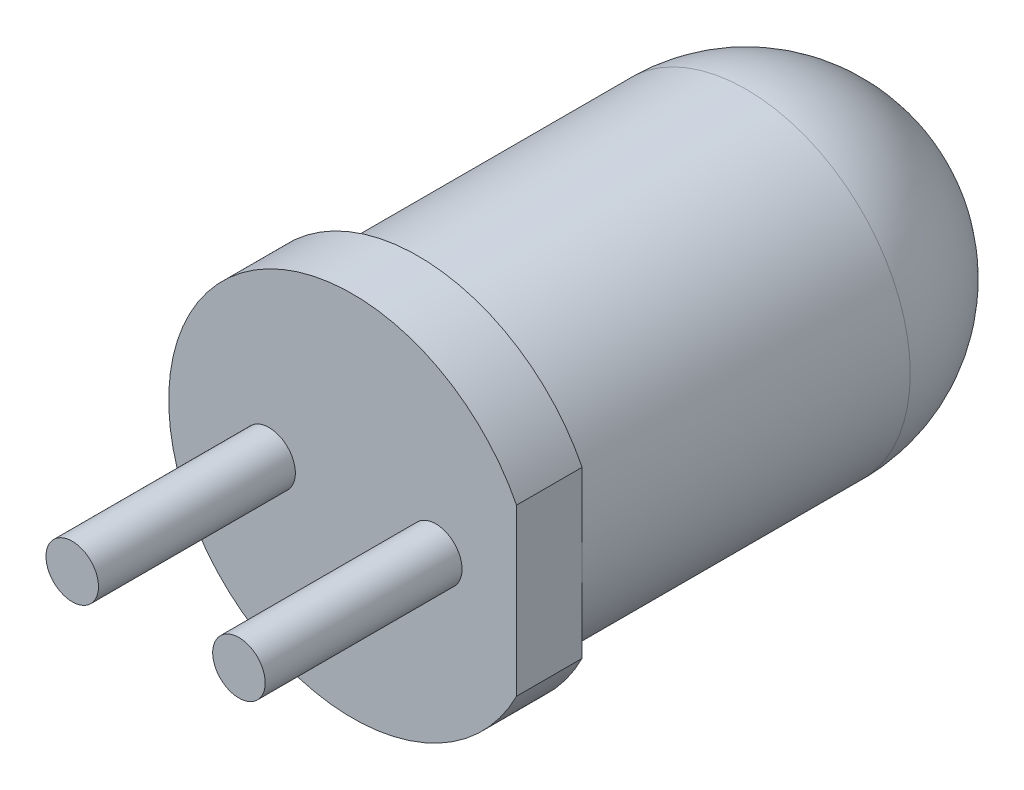
ISO-10303-21;
HEADER;
FILE_DESCRIPTION(('STEP AP214'),'2;1');
FILE_NAME('part.step','',(''),(''),'','','');
FILE_SCHEMA(('AUTOMOTIVE_DESIGN { 1 0 10303 214 1 1 1 1 }'));
ENDSEC;
DATA;
#1=APPLICATION_CONTEXT('core data for automotive mechanical design processes');
#2=APPLICATION_PROTOCOL_DEFINITION('international standard','automotive_design',2000,#1);
#3=PRODUCT_CONTEXT('',#1,'mechanical');
#4=PRODUCT('Part','Part','',(#3));
#5=PRODUCT_RELATED_PRODUCT_CATEGORY('part','',(#4));
#6=PRODUCT_DEFINITION_FORMATION('','',#4);
#7=PRODUCT_DEFINITION_CONTEXT('part definition',#1,'design');
#8=PRODUCT_DEFINITION('design','',#6,#7);
#9=PRODUCT_DEFINITION_SHAPE('','',#8);
#10=(LENGTH_UNIT() NAMED_UNIT(*) SI_UNIT(.MILLI.,.METRE.));
#11=(NAMED_UNIT(*) PLANE_ANGLE_UNIT() SI_UNIT($,.RADIAN.));
#12=(NAMED_UNIT(*) SI_UNIT($,.STERADIAN.) SOLID_ANGLE_UNIT());
#13=UNCERTAINTY_MEASURE_WITH_UNIT(LENGTH_MEASURE(1.E-05),#10,'distance_accuracy_value','');
#14=(GEOMETRIC_REPRESENTATION_CONTEXT(3) GLOBAL_UNCERTAINTY_ASSIGNED_CONTEXT((#13)) GLOBAL_UNIT_ASSIGNED_CONTEXT((#10,
#11,#12)) REPRESENTATION_CONTEXT('',''));
#15=CARTESIAN_POINT('',(0.,0.,0.));
#16=DIRECTION('',(0.,0.,1.));
#17=DIRECTION('',(1.,0.,0.));
#18=AXIS2_PLACEMENT_3D('',#15,#16,#17);
#19=CARTESIAN_POINT('',(0.,0.,8.5));
#20=DIRECTION('',(0.,0.,1.));
#21=DIRECTION('',(1.,0.,0.));
#22=AXIS2_PLACEMENT_3D('',#19,#20,#21);
#23=PLANE('',#22);
#24=CARTESIAN_POINT('',(1.27,0.,8.5));
#25=DIRECTION('',(0.,0.,1.));
#26=DIRECTION('',(1.,0.,0.));
#27=AXIS2_PLACEMENT_3D('',#24,#25,#26);
#28=CIRCLE('',#27,0.4);
#29=CARTESIAN_POINT('',(1.67,0.,8.5));
#30=VERTEX_POINT('',#29);
#31=EDGE_CURVE('E135',#30,#30,#28,.T.);
#32=ORIENTED_EDGE('',*,*,#31,.F.);
#33=EDGE_LOOP('',(#32));
#34=FACE_BOUND('',#33,.T.);
#35=DIRECTION('',(0.,1.,0.));
#36=VECTOR('',#35,1.);
#37=CARTESIAN_POINT('',(2.5,1.26095202129185,8.5));
#38=LINE('',#37,#36);
#39=CARTESIAN_POINT('',(2.5,-1.26095202129185,8.5));
#40=VERTEX_POINT('',#39);
#41=CARTESIAN_POINT('',(2.5,1.26095202129185,8.5));
#42=VERTEX_POINT('',#41);
#43=EDGE_CURVE('E79',#40,#42,#38,.T.);
#44=ORIENTED_EDGE('',*,*,#43,.T.);
#45=CARTESIAN_POINT('',(0.,0.,8.5));
#46=DIRECTION('',(0.,0.,1.));
#47=DIRECTION('',(1.,0.,0.));
#48=AXIS2_PLACEMENT_3D('',#45,#46,#47);
#49=CIRCLE('',#48,2.8);
#50=EDGE_CURVE('E69',#42,#40,#49,.T.);
#51=ORIENTED_EDGE('',*,*,#50,.T.);
#52=EDGE_LOOP('',(#44,#51));
#53=FACE_BOUND('',#52,.T.);
#54=CARTESIAN_POINT('',(-1.27,0.,8.5));
#55=DIRECTION('',(0.,0.,1.));
#56=DIRECTION('',(-1.,0.,0.));
#57=AXIS2_PLACEMENT_3D('',#54,#55,#56);
#58=CIRCLE('',#57,0.4);
#59=CARTESIAN_POINT('',(-1.67,0.,8.5));
#60=VERTEX_POINT('',#59);
#61=EDGE_CURVE('E136',#60,#60,#58,.T.);
#62=ORIENTED_EDGE('',*,*,#61,.F.);
#63=EDGE_LOOP('',(#62));
#64=FACE_BOUND('',#63,.T.);
#65=ADVANCED_FACE('F34',(#34,#53,#64),#23,.T.);
#66=CARTESIAN_POINT('',(0.,0.,8.5));
#67=DIRECTION('',(0.,0.,-1.));
#68=DIRECTION('',(-1.,0.,0.));
#69=AXIS2_PLACEMENT_3D('',#66,#67,#68);
#70=CYLINDRICAL_SURFACE('',#69,2.5);
#71=CARTESIAN_POINT('',(0.,0.,2.5));
#72=DIRECTION('',(0.,0.,-1.));
#73=DIRECTION('',(-1.,0.,0.));
#74=AXIS2_PLACEMENT_3D('',#71,#72,#73);
#75=CIRCLE('',#74,2.5);
#76=CARTESIAN_POINT('',(-2.5,0.,2.5));
#77=VERTEX_POINT('',#76);
#78=EDGE_CURVE('E11',#77,#77,#75,.F.);
#79=ORIENTED_EDGE('',*,*,#78,.T.);
#80=EDGE_LOOP('',(#79));
#81=FACE_BOUND('',#80,.T.);
#82=CARTESIAN_POINT('',(0.,0.,7.5));
#83=DIRECTION('',(0.,0.,1.));
#84=DIRECTION('',(1.,0.,0.));
#85=AXIS2_PLACEMENT_3D('',#82,#83,#84);
#86=CIRCLE('',#85,2.5);
#87=CARTESIAN_POINT('',(2.5,0.,7.5));
#88=VERTEX_POINT('',#87);
#89=EDGE_CURVE('E42',#88,#88,#86,.T.);
#90=ORIENTED_EDGE('',*,*,#89,.F.);
#91=EDGE_LOOP('',(#90));
#92=FACE_BOUND('',#91,.T.);
#93=ADVANCED_FACE('F36',(#81,#92),#70,.T.);
#94=CARTESIAN_POINT('',(0.,0.,7.5));
#95=DIRECTION('',(0.,0.,1.));
#96=DIRECTION('',(1.,0.,0.));
#97=AXIS2_PLACEMENT_3D('',#94,#95,#96);
#98=PLANE('',#97);
#99=DIRECTION('',(0.,1.,0.));
#100=VECTOR('',#99,1.);
#101=CARTESIAN_POINT('',(2.5,1.26095202129185,7.5));
#102=LINE('',#101,#100);
#103=CARTESIAN_POINT('',(2.5,1.26095202129185,7.5));
#104=VERTEX_POINT('',#103);
#105=EDGE_CURVE('E53',#88,#104,#102,.T.);
#106=ORIENTED_EDGE('',*,*,#105,.F.);
#107=ORIENTED_EDGE('',*,*,#89,.T.);
#108=CARTESIAN_POINT('',(2.5,-1.26095202129185,7.5));
#109=VERTEX_POINT('',#108);
#110=EDGE_CURVE('E75',#109,#88,#102,.T.);
#111=ORIENTED_EDGE('',*,*,#110,.F.);
#112=CARTESIAN_POINT('',(0.,0.,7.5));
#113=DIRECTION('',(0.,0.,1.));
#114=DIRECTION('',(1.,0.,0.));
#115=AXIS2_PLACEMENT_3D('',#112,#113,#114);
#116=CIRCLE('',#115,2.8);
#117=EDGE_CURVE('E71',#104,#109,#116,.T.);
#118=ORIENTED_EDGE('',*,*,#117,.F.);
#119=EDGE_LOOP('',(#106,#107,#111,#118));
#120=FACE_BOUND('',#119,.T.);
#121=ADVANCED_FACE('F89',(#120),#98,.F.);
#122=CARTESIAN_POINT('',(2.5,1.26095202129185,7.5));
#123=DIRECTION('',(1.,0.,0.));
#124=DIRECTION('',(0.,0.,-1.));
#125=AXIS2_PLACEMENT_3D('',#122,#123,#124);
#126=PLANE('',#125);
#127=ORIENTED_EDGE('',*,*,#110,.T.);
#128=ORIENTED_EDGE('',*,*,#105,.T.);
#129=DIRECTION('',(0.,0.,1.));
#130=VECTOR('',#129,1.);
#131=CARTESIAN_POINT('',(2.5,1.26095202129185,7.5));
#132=LINE('',#131,#130);
#133=EDGE_CURVE('E74',#104,#42,#132,.T.);
#134=ORIENTED_EDGE('',*,*,#133,.T.);
#135=ORIENTED_EDGE('',*,*,#43,.F.);
#136=DIRECTION('',(0.,0.,1.));
#137=VECTOR('',#136,1.);
#138=CARTESIAN_POINT('',(2.5,-1.26095202129185,7.5));
#139=LINE('',#138,#137);
#140=EDGE_CURVE('E66',#109,#40,#139,.T.);
#141=ORIENTED_EDGE('',*,*,#140,.F.);
#142=EDGE_LOOP('',(#127,#128,#134,#135,#141));
#143=FACE_BOUND('',#142,.T.);
#144=ADVANCED_FACE('F82',(#143),#126,.T.);
#145=CARTESIAN_POINT('',(0.,0.,7.5));
#146=DIRECTION('',(0.,0.,1.));
#147=DIRECTION('',(1.,0.,0.));
#148=AXIS2_PLACEMENT_3D('',#145,#146,#147);
#149=CYLINDRICAL_SURFACE('',#148,2.8);
#150=ORIENTED_EDGE('',*,*,#50,.F.);
#151=ORIENTED_EDGE('',*,*,#133,.F.);
#152=ORIENTED_EDGE('',*,*,#117,.T.);
#153=ORIENTED_EDGE('',*,*,#140,.T.);
#154=EDGE_LOOP('',(#150,#151,#152,#153));
#155=FACE_BOUND('',#154,.T.);
#156=ADVANCED_FACE('F68',(#155),#149,.T.);
#157=CARTESIAN_POINT('',(0.,0.,2.5));
#158=DIRECTION('',(0.,0.,1.));
#159=DIRECTION('',(1.,0.,0.));
#160=AXIS2_PLACEMENT_3D('',#157,#158,#159);
#161=SPHERICAL_SURFACE('',#160,2.5);
#162=ORIENTED_EDGE('',*,*,#78,.F.);
#163=EDGE_LOOP('',(#162));
#164=FACE_BOUND('',#163,.T.);
#165=ADVANCED_FACE('F106',(#164),#161,.T.);
#166=CARTESIAN_POINT('',(1.27,0.,11.5));
#167=DIRECTION('',(0.,0.,-1.));
#168=DIRECTION('',(-1.,0.,0.));
#169=AXIS2_PLACEMENT_3D('',#166,#167,#168);
#170=CYLINDRICAL_SURFACE('',#169,0.4);
#171=CARTESIAN_POINT('',(1.27,0.,11.5));
#172=DIRECTION('',(0.,0.,1.));
#173=DIRECTION('',(1.,0.,0.));
#174=AXIS2_PLACEMENT_3D('',#171,#172,#173);
#175=CIRCLE('',#174,0.4);
#176=CARTESIAN_POINT('',(1.67,0.,11.5));
#177=VERTEX_POINT('',#176);
#178=EDGE_CURVE('E80',#177,#177,#175,.T.);
#179=ORIENTED_EDGE('',*,*,#178,.F.);
#180=EDGE_LOOP('',(#179));
#181=FACE_BOUND('',#180,.T.);
#182=ORIENTED_EDGE('',*,*,#31,.T.);
#183=EDGE_LOOP('',(#182));
#184=FACE_BOUND('',#183,.T.);
#185=ADVANCED_FACE('F110',(#181,#184),#170,.T.);
#186=CARTESIAN_POINT('',(1.27,0.,11.5));
#187=DIRECTION('',(0.,0.,1.));
#188=DIRECTION('',(1.,0.,0.));
#189=AXIS2_PLACEMENT_3D('',#186,#187,#188);
#190=PLANE('',#189);
#191=ORIENTED_EDGE('',*,*,#178,.T.);
#192=EDGE_LOOP('',(#191));
#193=FACE_BOUND('',#192,.T.);
#194=ADVANCED_FACE('F115',(#193),#190,.T.);
#195=CARTESIAN_POINT('',(-1.27,0.,11.5));
#196=DIRECTION('',(0.,0.,-1.));
#197=DIRECTION('',(-1.,0.,0.));
#198=AXIS2_PLACEMENT_3D('',#195,#196,#197);
#199=CYLINDRICAL_SURFACE('',#198,0.4);
#200=CARTESIAN_POINT('',(-1.27,0.,11.5));
#201=DIRECTION('',(0.,0.,1.));
#202=DIRECTION('',(-1.,0.,0.));
#203=AXIS2_PLACEMENT_3D('',#200,#201,#202);
#204=CIRCLE('',#203,0.4);
#205=CARTESIAN_POINT('',(-1.67,0.,11.5));
#206=VERTEX_POINT('',#205);
#207=EDGE_CURVE('E134',#206,#206,#204,.T.);
#208=ORIENTED_EDGE('',*,*,#207,.F.);
#209=EDGE_LOOP('',(#208));
#210=FACE_BOUND('',#209,.T.);
#211=ORIENTED_EDGE('',*,*,#61,.T.);
#212=EDGE_LOOP('',(#211));
#213=FACE_BOUND('',#212,.T.);
#214=ADVANCED_FACE('F122',(#210,#213),#199,.T.);
#215=CARTESIAN_POINT('',(-1.27,0.,11.5));
#216=DIRECTION('',(0.,0.,-1.));
#217=DIRECTION('',(-1.,0.,0.));
#218=AXIS2_PLACEMENT_3D('',#215,#216,#217);
#219=PLANE('',#218);
#220=ORIENTED_EDGE('',*,*,#207,.T.);
#221=EDGE_LOOP('',(#220));
#222=FACE_BOUND('',#221,.T.);
#223=ADVANCED_FACE('F126',(#222),#219,.F.);
#224=CLOSED_SHELL('',(#65,#93,#121,#144,#156,#165,#185,#194,#214,#223));
#225=MANIFOLD_SOLID_BREP('B2',#224);
#226=ADVANCED_BREP_SHAPE_REPRESENTATION('',(#18,#225),#14);
#227=SHAPE_DEFINITION_REPRESENTATION(#9,#226);
ENDSEC;
END-ISO-10303-21;
